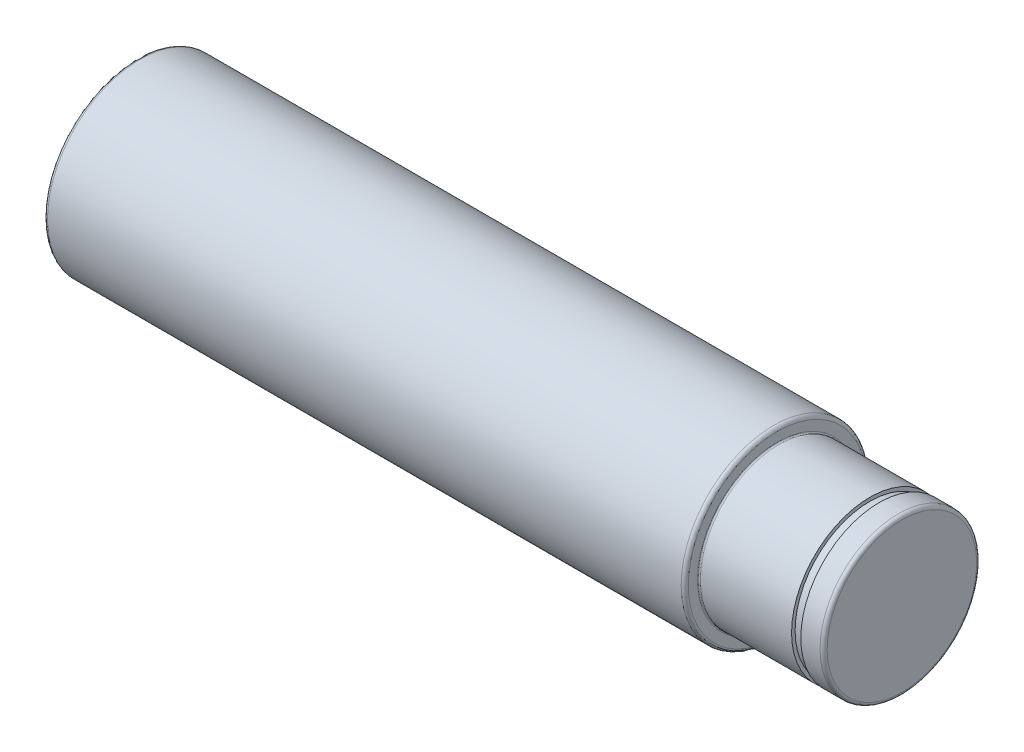
ISO-10303-21;
HEADER;
FILE_DESCRIPTION(('STEP AP214'),'2;1');
FILE_NAME('part.step','',(''),(''),'','','');
FILE_SCHEMA(('AUTOMOTIVE_DESIGN { 1 0 10303 214 1 1 1 1 }'));
ENDSEC;
DATA;
#1=APPLICATION_CONTEXT('core data for automotive mechanical design processes');
#2=APPLICATION_PROTOCOL_DEFINITION('international standard','automotive_design',2000,#1);
#3=PRODUCT_CONTEXT('',#1,'mechanical');
#4=PRODUCT('Part','Part','',(#3));
#5=PRODUCT_RELATED_PRODUCT_CATEGORY('part','',(#4));
#6=PRODUCT_DEFINITION_FORMATION('','',#4);
#7=PRODUCT_DEFINITION_CONTEXT('part definition',#1,'design');
#8=PRODUCT_DEFINITION('design','',#6,#7);
#9=PRODUCT_DEFINITION_SHAPE('','',#8);
#10=(LENGTH_UNIT() NAMED_UNIT(*) SI_UNIT(.MILLI.,.METRE.));
#11=(NAMED_UNIT(*) PLANE_ANGLE_UNIT() SI_UNIT($,.RADIAN.));
#12=(NAMED_UNIT(*) SI_UNIT($,.STERADIAN.) SOLID_ANGLE_UNIT());
#13=UNCERTAINTY_MEASURE_WITH_UNIT(LENGTH_MEASURE(1.E-05),#10,'distance_accuracy_value','');
#14=(GEOMETRIC_REPRESENTATION_CONTEXT(3) GLOBAL_UNCERTAINTY_ASSIGNED_CONTEXT((#13)) GLOBAL_UNIT_ASSIGNED_CONTEXT((#10,
#11,#12)) REPRESENTATION_CONTEXT('',''));
#15=CARTESIAN_POINT('',(0.,0.,0.));
#16=DIRECTION('',(0.,0.,1.));
#17=DIRECTION('',(1.,0.,0.));
#18=AXIS2_PLACEMENT_3D('',#15,#16,#17);
#19=CARTESIAN_POINT('',(0.,0.,0.));
#20=DIRECTION('',(1.,0.,0.));
#21=DIRECTION('',(0.,0.,-1.));
#22=AXIS2_PLACEMENT_3D('',#19,#20,#21);
#23=PLANE('',#22);
#24=CARTESIAN_POINT('',(0.,0.,0.));
#25=DIRECTION('',(-1.,0.,0.));
#26=DIRECTION('',(0.,0.,1.));
#27=AXIS2_PLACEMENT_3D('',#24,#25,#26);
#28=CIRCLE('',#27,12.5);
#29=CARTESIAN_POINT('',(0.,0.,12.5));
#30=VERTEX_POINT('',#29);
#31=EDGE_CURVE('E10',#30,#30,#28,.T.);
#32=ORIENTED_EDGE('',*,*,#31,.T.);
#33=EDGE_LOOP('',(#32));
#34=FACE_BOUND('',#33,.T.);
#35=ADVANCED_FACE('F37',(#34),#23,.F.);
#36=CARTESIAN_POINT('',(0.5,0.,0.));
#37=DIRECTION('',(-1.,0.,0.));
#38=DIRECTION('',(0.,0.,1.));
#39=AXIS2_PLACEMENT_3D('',#36,#37,#38);
#40=TOROIDAL_SURFACE('',#39,12.5,0.5);
#41=ORIENTED_EDGE('',*,*,#31,.F.);
#42=EDGE_LOOP('',(#41));
#43=FACE_BOUND('',#42,.T.);
#44=CARTESIAN_POINT('',(0.5,0.,0.));
#45=DIRECTION('',(-1.,0.,0.));
#46=DIRECTION('',(0.,0.,1.));
#47=AXIS2_PLACEMENT_3D('',#44,#45,#46);
#48=CIRCLE('',#47,13.);
#49=CARTESIAN_POINT('',(0.5,0.,13.));
#50=VERTEX_POINT('',#49);
#51=EDGE_CURVE('E43',#50,#50,#48,.T.);
#52=ORIENTED_EDGE('',*,*,#51,.T.);
#53=EDGE_LOOP('',(#52));
#54=FACE_BOUND('',#53,.T.);
#55=ADVANCED_FACE('F93',(#43,#54),#40,.T.);
#56=CARTESIAN_POINT('',(0.,0.,0.));
#57=DIRECTION('',(-1.,0.,0.));
#58=DIRECTION('',(0.,0.,1.));
#59=AXIS2_PLACEMENT_3D('',#56,#57,#58);
#60=CYLINDRICAL_SURFACE('',#59,13.);
#61=ORIENTED_EDGE('',*,*,#51,.F.);
#62=EDGE_LOOP('',(#61));
#63=FACE_BOUND('',#62,.T.);
#64=CARTESIAN_POINT('',(89.5,0.,0.));
#65=DIRECTION('',(-1.,0.,0.));
#66=DIRECTION('',(0.,0.,1.));
#67=AXIS2_PLACEMENT_3D('',#64,#65,#66);
#68=CIRCLE('',#67,13.);
#69=CARTESIAN_POINT('',(89.5,0.,13.));
#70=VERTEX_POINT('',#69);
#71=EDGE_CURVE('E47',#70,#70,#68,.T.);
#72=ORIENTED_EDGE('',*,*,#71,.T.);
#73=EDGE_LOOP('',(#72));
#74=FACE_BOUND('',#73,.T.);
#75=ADVANCED_FACE('F97',(#63,#74),#60,.T.);
#76=CARTESIAN_POINT('',(89.5,0.,0.));
#77=DIRECTION('',(-1.,0.,0.));
#78=DIRECTION('',(0.,0.,1.));
#79=AXIS2_PLACEMENT_3D('',#76,#77,#78);
#80=TOROIDAL_SURFACE('',#79,12.5,0.5);
#81=ORIENTED_EDGE('',*,*,#71,.F.);
#82=EDGE_LOOP('',(#81));
#83=FACE_BOUND('',#82,.T.);
#84=CARTESIAN_POINT('',(90.,0.,0.));
#85=DIRECTION('',(-1.,0.,0.));
#86=DIRECTION('',(0.,0.,1.));
#87=AXIS2_PLACEMENT_3D('',#84,#85,#86);
#88=CIRCLE('',#87,12.5);
#89=CARTESIAN_POINT('',(90.,0.,12.5));
#90=VERTEX_POINT('',#89);
#91=EDGE_CURVE('E51',#90,#90,#88,.T.);
#92=ORIENTED_EDGE('',*,*,#91,.T.);
#93=EDGE_LOOP('',(#92));
#94=FACE_BOUND('',#93,.T.);
#95=ADVANCED_FACE('F102',(#83,#94),#80,.T.);
#96=CARTESIAN_POINT('',(90.,12.5,0.));
#97=DIRECTION('',(-1.,0.,0.));
#98=DIRECTION('',(0.,0.,1.));
#99=AXIS2_PLACEMENT_3D('',#96,#97,#98);
#100=PLANE('',#99);
#101=ORIENTED_EDGE('',*,*,#91,.F.);
#102=EDGE_LOOP('',(#101));
#103=FACE_BOUND('',#102,.T.);
#104=CARTESIAN_POINT('',(90.,0.,0.));
#105=DIRECTION('',(-1.,0.,0.));
#106=DIRECTION('',(0.,0.,1.));
#107=AXIS2_PLACEMENT_3D('',#104,#105,#106);
#108=CIRCLE('',#107,11.2);
#109=CARTESIAN_POINT('',(90.,0.,11.2));
#110=VERTEX_POINT('',#109);
#111=EDGE_CURVE('E56',#110,#110,#108,.T.);
#112=ORIENTED_EDGE('',*,*,#111,.T.);
#113=EDGE_LOOP('',(#112));
#114=FACE_BOUND('',#113,.T.);
#115=ADVANCED_FACE('F108',(#103,#114),#100,.F.);
#116=CARTESIAN_POINT('',(90.2,0.,0.));
#117=DIRECTION('',(-1.,0.,0.));
#118=DIRECTION('',(0.,0.,1.));
#119=AXIS2_PLACEMENT_3D('',#116,#117,#118);
#120=TOROIDAL_SURFACE('',#119,11.2,0.200000000000003);
#121=ORIENTED_EDGE('',*,*,#111,.F.);
#122=EDGE_LOOP('',(#121));
#123=FACE_BOUND('',#122,.T.);
#124=CARTESIAN_POINT('',(90.2,0.,0.));
#125=DIRECTION('',(-1.,0.,0.));
#126=DIRECTION('',(0.,0.,1.));
#127=AXIS2_PLACEMENT_3D('',#124,#125,#126);
#128=CIRCLE('',#127,11.);
#129=CARTESIAN_POINT('',(90.2,0.,11.));
#130=VERTEX_POINT('',#129);
#131=EDGE_CURVE('E59',#130,#130,#128,.T.);
#132=ORIENTED_EDGE('',*,*,#131,.T.);
#133=EDGE_LOOP('',(#132));
#134=FACE_BOUND('',#133,.T.);
#135=ADVANCED_FACE('F112',(#123,#134),#120,.F.);
#136=CARTESIAN_POINT('',(0.,0.,0.));
#137=DIRECTION('',(-1.,0.,0.));
#138=DIRECTION('',(0.,0.,1.));
#139=AXIS2_PLACEMENT_3D('',#136,#137,#138);
#140=CYLINDRICAL_SURFACE('',#139,11.);
#141=ORIENTED_EDGE('',*,*,#131,.F.);
#142=EDGE_LOOP('',(#141));
#143=FACE_BOUND('',#142,.T.);
#144=CARTESIAN_POINT('',(103.,0.,0.));
#145=DIRECTION('',(-1.,0.,0.));
#146=DIRECTION('',(0.,0.,1.));
#147=AXIS2_PLACEMENT_3D('',#144,#145,#146);
#148=CIRCLE('',#147,11.);
#149=CARTESIAN_POINT('',(103.,0.,11.));
#150=VERTEX_POINT('',#149);
#151=EDGE_CURVE('E62',#150,#150,#148,.T.);
#152=ORIENTED_EDGE('',*,*,#151,.T.);
#153=EDGE_LOOP('',(#152));
#154=FACE_BOUND('',#153,.T.);
#155=ADVANCED_FACE('F116',(#143,#154),#140,.T.);
#156=CARTESIAN_POINT('',(103.,11.,0.));
#157=DIRECTION('',(-1.,0.,0.));
#158=DIRECTION('',(0.,0.,1.));
#159=AXIS2_PLACEMENT_3D('',#156,#157,#158);
#160=PLANE('',#159);
#161=ORIENTED_EDGE('',*,*,#151,.F.);
#162=EDGE_LOOP('',(#161));
#163=FACE_BOUND('',#162,.T.);
#164=CARTESIAN_POINT('',(103.,0.,0.));
#165=DIRECTION('',(-1.,0.,0.));
#166=DIRECTION('',(0.,0.,1.));
#167=AXIS2_PLACEMENT_3D('',#164,#165,#166);
#168=CIRCLE('',#167,10.5);
#169=CARTESIAN_POINT('',(103.,0.,10.5));
#170=VERTEX_POINT('',#169);
#171=EDGE_CURVE('E65',#170,#170,#168,.T.);
#172=ORIENTED_EDGE('',*,*,#171,.T.);
#173=EDGE_LOOP('',(#172));
#174=FACE_BOUND('',#173,.T.);
#175=ADVANCED_FACE('F120',(#163,#174),#160,.F.);
#176=CARTESIAN_POINT('',(0.,0.,0.));
#177=DIRECTION('',(-1.,0.,0.));
#178=DIRECTION('',(0.,0.,1.));
#179=AXIS2_PLACEMENT_3D('',#176,#177,#178);
#180=CYLINDRICAL_SURFACE('',#179,10.5);
#181=ORIENTED_EDGE('',*,*,#171,.F.);
#182=EDGE_LOOP('',(#181));
#183=FACE_BOUND('',#182,.T.);
#184=CARTESIAN_POINT('',(104.3,0.,0.));
#185=DIRECTION('',(-1.,0.,0.));
#186=DIRECTION('',(0.,0.,1.));
#187=AXIS2_PLACEMENT_3D('',#184,#185,#186);
#188=CIRCLE('',#187,10.5);
#189=CARTESIAN_POINT('',(104.3,0.,10.5));
#190=VERTEX_POINT('',#189);
#191=EDGE_CURVE('E68',#190,#190,#188,.T.);
#192=ORIENTED_EDGE('',*,*,#191,.T.);
#193=EDGE_LOOP('',(#192));
#194=FACE_BOUND('',#193,.T.);
#195=ADVANCED_FACE('F124',(#183,#194),#180,.T.);
#196=CARTESIAN_POINT('',(104.3,10.5,0.));
#197=DIRECTION('',(1.,0.,0.));
#198=DIRECTION('',(0.,0.,-1.));
#199=AXIS2_PLACEMENT_3D('',#196,#197,#198);
#200=PLANE('',#199);
#201=ORIENTED_EDGE('',*,*,#191,.F.);
#202=EDGE_LOOP('',(#201));
#203=FACE_BOUND('',#202,.T.);
#204=CARTESIAN_POINT('',(104.3,0.,0.));
#205=DIRECTION('',(-1.,0.,0.));
#206=DIRECTION('',(0.,0.,1.));
#207=AXIS2_PLACEMENT_3D('',#204,#205,#206);
#208=CIRCLE('',#207,11.);
#209=CARTESIAN_POINT('',(104.3,0.,11.));
#210=VERTEX_POINT('',#209);
#211=EDGE_CURVE('E71',#210,#210,#208,.T.);
#212=ORIENTED_EDGE('',*,*,#211,.T.);
#213=EDGE_LOOP('',(#212));
#214=FACE_BOUND('',#213,.T.);
#215=ADVANCED_FACE('F128',(#203,#214),#200,.F.);
#216=CARTESIAN_POINT('',(0.,0.,0.));
#217=DIRECTION('',(-1.,0.,0.));
#218=DIRECTION('',(0.,0.,1.));
#219=AXIS2_PLACEMENT_3D('',#216,#217,#218);
#220=CYLINDRICAL_SURFACE('',#219,11.);
#221=ORIENTED_EDGE('',*,*,#211,.F.);
#222=EDGE_LOOP('',(#221));
#223=FACE_BOUND('',#222,.T.);
#224=CARTESIAN_POINT('',(107.,0.,0.));
#225=DIRECTION('',(-1.,0.,0.));
#226=DIRECTION('',(0.,0.,1.));
#227=AXIS2_PLACEMENT_3D('',#224,#225,#226);
#228=CIRCLE('',#227,11.);
#229=CARTESIAN_POINT('',(107.,0.,11.));
#230=VERTEX_POINT('',#229);
#231=EDGE_CURVE('E74',#230,#230,#228,.T.);
#232=ORIENTED_EDGE('',*,*,#231,.T.);
#233=EDGE_LOOP('',(#232));
#234=FACE_BOUND('',#233,.T.);
#235=ADVANCED_FACE('F89',(#223,#234),#220,.T.);
#236=CARTESIAN_POINT('',(107.,0.,0.));
#237=DIRECTION('',(-1.,0.,0.));
#238=DIRECTION('',(0.,0.,1.));
#239=AXIS2_PLACEMENT_3D('',#236,#237,#238);
#240=TOROIDAL_SURFACE('',#239,10.5,0.500000000000001);
#241=ORIENTED_EDGE('',*,*,#231,.F.);
#242=EDGE_LOOP('',(#241));
#243=FACE_BOUND('',#242,.T.);
#244=CARTESIAN_POINT('',(107.5,0.,0.));
#245=DIRECTION('',(-1.,0.,0.));
#246=DIRECTION('',(0.,0.,1.));
#247=AXIS2_PLACEMENT_3D('',#244,#245,#246);
#248=CIRCLE('',#247,10.5);
#249=CARTESIAN_POINT('',(107.5,0.,10.5));
#250=VERTEX_POINT('',#249);
#251=EDGE_CURVE('E77',#250,#250,#248,.T.);
#252=ORIENTED_EDGE('',*,*,#251,.T.);
#253=EDGE_LOOP('',(#252));
#254=FACE_BOUND('',#253,.T.);
#255=ADVANCED_FACE('F81',(#243,#254),#240,.T.);
#256=CARTESIAN_POINT('',(107.5,10.5,0.));
#257=DIRECTION('',(-1.,0.,0.));
#258=DIRECTION('',(0.,0.,1.));
#259=AXIS2_PLACEMENT_3D('',#256,#257,#258);
#260=PLANE('',#259);
#261=ORIENTED_EDGE('',*,*,#251,.F.);
#262=EDGE_LOOP('',(#261));
#263=FACE_BOUND('',#262,.T.);
#264=ADVANCED_FACE('F83',(#263),#260,.F.);
#265=CLOSED_SHELL('',(#35,#55,#75,#95,#115,#135,#155,#175,#195,#215,#235,#255,#264));
#266=MANIFOLD_SOLID_BREP('B2',#265);
#267=ADVANCED_BREP_SHAPE_REPRESENTATION('',(#18,#266),#14);
#268=SHAPE_DEFINITION_REPRESENTATION(#9,#267);
ENDSEC;
END-ISO-10303-21;
